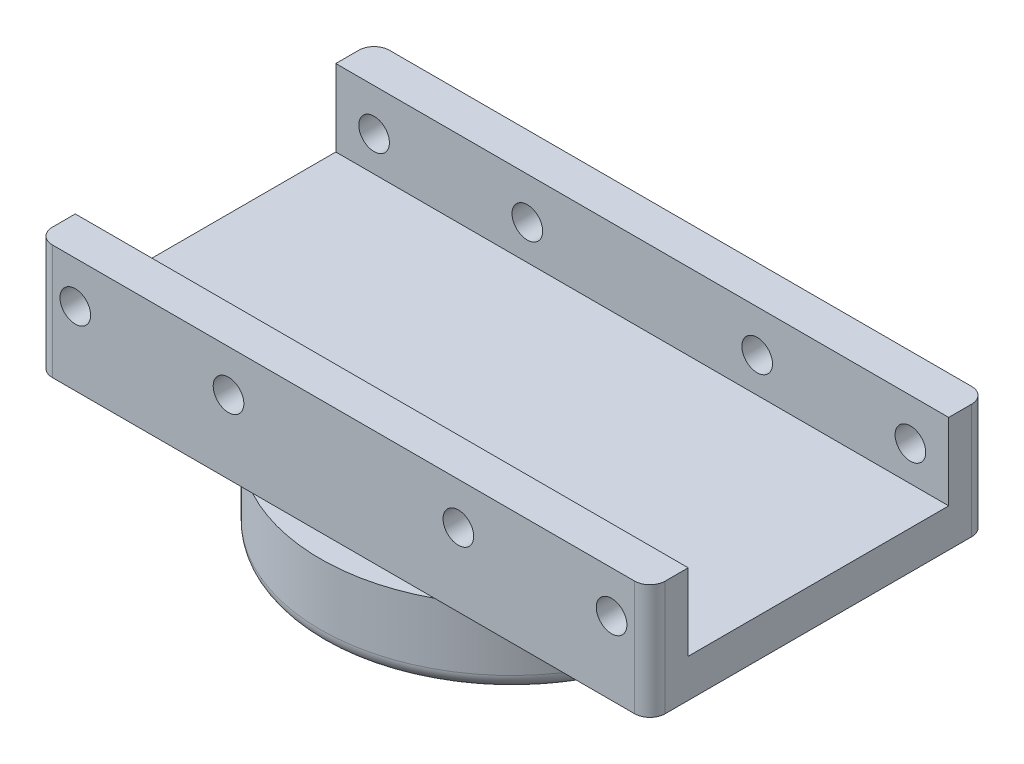
ISO-10303-21;
HEADER;
FILE_DESCRIPTION(('STEP AP214'),'2;1');
FILE_NAME('part.step','',(''),(''),'','','');
FILE_SCHEMA(('AUTOMOTIVE_DESIGN { 1 0 10303 214 1 1 1 1 }'));
ENDSEC;
DATA;
#1=APPLICATION_CONTEXT('core data for automotive mechanical design processes');
#2=APPLICATION_PROTOCOL_DEFINITION('international standard','automotive_design',2000,#1);
#3=PRODUCT_CONTEXT('',#1,'mechanical');
#4=PRODUCT('Part','Part','',(#3));
#5=PRODUCT_RELATED_PRODUCT_CATEGORY('part','',(#4));
#6=PRODUCT_DEFINITION_FORMATION('','',#4);
#7=PRODUCT_DEFINITION_CONTEXT('part definition',#1,'design');
#8=PRODUCT_DEFINITION('design','',#6,#7);
#9=PRODUCT_DEFINITION_SHAPE('','',#8);
#10=(LENGTH_UNIT() NAMED_UNIT(*) SI_UNIT(.MILLI.,.METRE.));
#11=(NAMED_UNIT(*) PLANE_ANGLE_UNIT() SI_UNIT($,.RADIAN.));
#12=(NAMED_UNIT(*) SI_UNIT($,.STERADIAN.) SOLID_ANGLE_UNIT());
#13=UNCERTAINTY_MEASURE_WITH_UNIT(LENGTH_MEASURE(1.E-05),#10,'distance_accuracy_value','');
#14=(GEOMETRIC_REPRESENTATION_CONTEXT(3) GLOBAL_UNCERTAINTY_ASSIGNED_CONTEXT((#13)) GLOBAL_UNIT_ASSIGNED_CONTEXT((#10,
#11,#12)) REPRESENTATION_CONTEXT('',''));
#15=CARTESIAN_POINT('',(0.,0.,0.));
#16=DIRECTION('',(0.,0.,1.));
#17=DIRECTION('',(1.,0.,0.));
#18=AXIS2_PLACEMENT_3D('',#15,#16,#17);
#19=CARTESIAN_POINT('',(0.,15.,0.));
#20=DIRECTION('',(0.,-1.,0.));
#21=DIRECTION('',(0.,0.,-1.));
#22=AXIS2_PLACEMENT_3D('',#19,#20,#21);
#23=PLANE('',#22);
#24=DIRECTION('',(-1.,0.,0.));
#25=VECTOR('',#24,1.);
#26=CARTESIAN_POINT('',(-40.,15.,17.));
#27=LINE('',#26,#25);
#28=CARTESIAN_POINT('',(40.,15.,17.));
#29=VERTEX_POINT('',#28);
#30=CARTESIAN_POINT('',(-40.,15.,17.));
#31=VERTEX_POINT('',#30);
#32=EDGE_CURVE('E165',#29,#31,#27,.T.);
#33=ORIENTED_EDGE('',*,*,#32,.F.);
#34=DIRECTION('',(0.,0.,-1.));
#35=VECTOR('',#34,1.);
#36=CARTESIAN_POINT('',(40.,15.,22.));
#37=LINE('',#36,#35);
#38=CARTESIAN_POINT('',(40.,15.,-17.));
#39=VERTEX_POINT('',#38);
#40=EDGE_CURVE('E152',#29,#39,#37,.T.);
#41=ORIENTED_EDGE('',*,*,#40,.T.);
#42=DIRECTION('',(1.,0.,0.));
#43=VECTOR('',#42,1.);
#44=CARTESIAN_POINT('',(-40.,15.,-17.));
#45=LINE('',#44,#43);
#46=CARTESIAN_POINT('',(-40.,15.,-17.));
#47=VERTEX_POINT('',#46);
#48=EDGE_CURVE('E155',#47,#39,#45,.T.);
#49=ORIENTED_EDGE('',*,*,#48,.F.);
#50=DIRECTION('',(0.,0.,1.));
#51=VECTOR('',#50,1.);
#52=CARTESIAN_POINT('',(-40.,15.,22.));
#53=LINE('',#52,#51);
#54=EDGE_CURVE('E188',#47,#31,#53,.T.);
#55=ORIENTED_EDGE('',*,*,#54,.T.);
#56=EDGE_LOOP('',(#33,#41,#49,#55));
#57=FACE_BOUND('',#56,.T.);
#58=ADVANCED_FACE('F33',(#57),#23,.F.);
#59=CARTESIAN_POINT('',(0.,10.,0.));
#60=DIRECTION('',(0.,1.,0.));
#61=DIRECTION('',(0.,0.,1.));
#62=AXIS2_PLACEMENT_3D('',#59,#60,#61);
#63=PLANE('',#62);
#64=DIRECTION('',(1.,0.,0.));
#65=VECTOR('',#64,1.);
#66=CARTESIAN_POINT('',(-40.,10.,22.));
#67=LINE('',#66,#65);
#68=CARTESIAN_POINT('',(-11.8743420870379,10.,22.));
#69=VERTEX_POINT('',#68);
#70=CARTESIAN_POINT('',(11.8743420870379,10.,22.));
#71=VERTEX_POINT('',#70);
#72=EDGE_CURVE('E202',#69,#71,#67,.T.);
#73=ORIENTED_EDGE('',*,*,#72,.F.);
#74=CARTESIAN_POINT('',(0.,10.,0.));
#75=DIRECTION('',(0.,1.,0.));
#76=DIRECTION('',(0.,0.,1.));
#77=AXIS2_PLACEMENT_3D('',#74,#75,#76);
#78=CIRCLE('',#77,25.);
#79=EDGE_CURVE('E191',#69,#71,#78,.T.);
#80=ORIENTED_EDGE('',*,*,#79,.T.);
#81=EDGE_LOOP('',(#73,#80));
#82=FACE_BOUND('',#81,.T.);
#83=ADVANCED_FACE('F286',(#82),#63,.T.);
#84=CARTESIAN_POINT('',(0.,10.,0.));
#85=DIRECTION('',(0.,-1.,0.));
#86=DIRECTION('',(0.,0.,-1.));
#87=AXIS2_PLACEMENT_3D('',#84,#85,#86);
#88=CYLINDRICAL_SURFACE('',#87,25.);
#89=CARTESIAN_POINT('',(0.,2.,0.));
#90=DIRECTION('',(0.,1.,0.));
#91=DIRECTION('',(0.,0.,1.));
#92=AXIS2_PLACEMENT_3D('',#89,#90,#91);
#93=CIRCLE('',#92,25.);
#94=CARTESIAN_POINT('',(0.,2.,25.));
#95=VERTEX_POINT('',#94);
#96=EDGE_CURVE('E216',#95,#95,#93,.T.);
#97=ORIENTED_EDGE('',*,*,#96,.T.);
#98=EDGE_LOOP('',(#97));
#99=FACE_BOUND('',#98,.T.);
#100=CARTESIAN_POINT('',(11.8743420870379,10.,-22.));
#101=VERTEX_POINT('',#100);
#102=EDGE_CURVE('E203',#71,#101,#78,.T.);
#103=ORIENTED_EDGE('',*,*,#102,.F.);
#104=ORIENTED_EDGE('',*,*,#79,.F.);
#105=CARTESIAN_POINT('',(-11.8743420870379,10.,-22.));
#106=VERTEX_POINT('',#105);
#107=EDGE_CURVE('E420',#106,#69,#78,.T.);
#108=ORIENTED_EDGE('',*,*,#107,.F.);
#109=EDGE_CURVE('E207',#101,#106,#78,.T.);
#110=ORIENTED_EDGE('',*,*,#109,.F.);
#111=EDGE_LOOP('',(#103,#104,#108,#110));
#112=FACE_BOUND('',#111,.T.);
#113=ADVANCED_FACE('F294',(#99,#112),#88,.T.);
#114=DIRECTION('',(-1.,0.,0.));
#115=VECTOR('',#114,1.);
#116=CARTESIAN_POINT('',(-40.,10.,-22.));
#117=LINE('',#116,#115);
#118=EDGE_CURVE('E197',#101,#106,#117,.T.);
#119=ORIENTED_EDGE('',*,*,#118,.F.);
#120=ORIENTED_EDGE('',*,*,#109,.T.);
#121=EDGE_LOOP('',(#119,#120));
#122=FACE_BOUND('',#121,.T.);
#123=ADVANCED_FACE('F297',(#122),#63,.T.);
#124=CARTESIAN_POINT('',(0.,0.,0.));
#125=DIRECTION('',(0.,1.,0.));
#126=DIRECTION('',(0.,0.,1.));
#127=AXIS2_PLACEMENT_3D('',#124,#125,#126);
#128=PLANE('',#127);
#129=CARTESIAN_POINT('',(0.,0.,0.));
#130=DIRECTION('',(0.,1.,0.));
#131=DIRECTION('',(0.,0.,1.));
#132=AXIS2_PLACEMENT_3D('',#129,#130,#131);
#133=CIRCLE('',#132,23.);
#134=CARTESIAN_POINT('',(0.,0.,23.));
#135=VERTEX_POINT('',#134);
#136=EDGE_CURVE('E219',#135,#135,#133,.F.);
#137=ORIENTED_EDGE('',*,*,#136,.T.);
#138=EDGE_LOOP('',(#137));
#139=FACE_BOUND('',#138,.T.);
#140=CARTESIAN_POINT('',(0.,0.,0.));
#141=DIRECTION('',(0.,1.,0.));
#142=DIRECTION('',(0.,0.,1.));
#143=AXIS2_PLACEMENT_3D('',#140,#141,#142);
#144=CIRCLE('',#143,10.);
#145=CARTESIAN_POINT('',(0.,0.,10.));
#146=VERTEX_POINT('',#145);
#147=EDGE_CURVE('E206',#146,#146,#144,.F.);
#148=ORIENTED_EDGE('',*,*,#147,.F.);
#149=EDGE_LOOP('',(#148));
#150=FACE_BOUND('',#149,.T.);
#151=ADVANCED_FACE('F326',(#139,#150),#128,.F.);
#152=CARTESIAN_POINT('',(0.,-10.,0.));
#153=DIRECTION('',(0.,1.,0.));
#154=DIRECTION('',(0.,0.,1.));
#155=AXIS2_PLACEMENT_3D('',#152,#153,#154);
#156=CYLINDRICAL_SURFACE('',#155,10.);
#157=CARTESIAN_POINT('',(0.,-8.,0.));
#158=DIRECTION('',(0.,-1.,0.));
#159=DIRECTION('',(0.,0.,-1.));
#160=AXIS2_PLACEMENT_3D('',#157,#158,#159);
#161=CIRCLE('',#160,10.);
#162=CARTESIAN_POINT('',(0.,-8.,-10.));
#163=VERTEX_POINT('',#162);
#164=EDGE_CURVE('E213',#163,#163,#161,.F.);
#165=ORIENTED_EDGE('',*,*,#164,.T.);
#166=EDGE_LOOP('',(#165));
#167=FACE_BOUND('',#166,.T.);
#168=ORIENTED_EDGE('',*,*,#147,.T.);
#169=EDGE_LOOP('',(#168));
#170=FACE_BOUND('',#169,.T.);
#171=ADVANCED_FACE('F323',(#167,#170),#156,.T.);
#172=CARTESIAN_POINT('',(0.,-10.,0.));
#173=DIRECTION('',(0.,-1.,0.));
#174=DIRECTION('',(0.,0.,-1.));
#175=AXIS2_PLACEMENT_3D('',#172,#173,#174);
#176=PLANE('',#175);
#177=CARTESIAN_POINT('',(0.,-10.,0.));
#178=DIRECTION('',(0.,-1.,0.));
#179=DIRECTION('',(0.,0.,-1.));
#180=AXIS2_PLACEMENT_3D('',#177,#178,#179);
#181=CIRCLE('',#180,8.);
#182=CARTESIAN_POINT('',(0.,-10.,-8.));
#183=VERTEX_POINT('',#182);
#184=EDGE_CURVE('E210',#183,#183,#181,.T.);
#185=ORIENTED_EDGE('',*,*,#184,.T.);
#186=EDGE_LOOP('',(#185));
#187=FACE_BOUND('',#186,.T.);
#188=ADVANCED_FACE('F319',(#187),#176,.T.);
#189=CARTESIAN_POINT('',(0.,-8.,0.));
#190=DIRECTION('',(0.,-1.,0.));
#191=DIRECTION('',(0.,0.,-1.));
#192=AXIS2_PLACEMENT_3D('',#189,#190,#191);
#193=TOROIDAL_SURFACE('',#192,8.,2.);
#194=ORIENTED_EDGE('',*,*,#164,.F.);
#195=EDGE_LOOP('',(#194));
#196=FACE_BOUND('',#195,.T.);
#197=ORIENTED_EDGE('',*,*,#184,.F.);
#198=EDGE_LOOP('',(#197));
#199=FACE_BOUND('',#198,.T.);
#200=ADVANCED_FACE('F322',(#196,#199),#193,.T.);
#201=CARTESIAN_POINT('',(0.,2.,0.));
#202=DIRECTION('',(0.,1.,0.));
#203=DIRECTION('',(0.,0.,1.));
#204=AXIS2_PLACEMENT_3D('',#201,#202,#203);
#205=TOROIDAL_SURFACE('',#204,23.,2.);
#206=ORIENTED_EDGE('',*,*,#136,.F.);
#207=EDGE_LOOP('',(#206));
#208=FACE_BOUND('',#207,.T.);
#209=ORIENTED_EDGE('',*,*,#96,.F.);
#210=EDGE_LOOP('',(#209));
#211=FACE_BOUND('',#210,.T.);
#212=ADVANCED_FACE('F338',(#208,#211),#205,.T.);
#213=CARTESIAN_POINT('',(0.,10.,0.));
#214=DIRECTION('',(0.,-1.,0.));
#215=DIRECTION('',(0.,0.,-1.));
#216=AXIS2_PLACEMENT_3D('',#213,#214,#215);
#217=PLANE('',#216);
#218=CARTESIAN_POINT('',(38.,10.,-22.));
#219=VERTEX_POINT('',#218);
#220=EDGE_CURVE('E194',#219,#101,#117,.T.);
#221=ORIENTED_EDGE('',*,*,#220,.F.);
#222=CARTESIAN_POINT('',(38.,10.,-20.));
#223=DIRECTION('',(0.,-1.,0.));
#224=DIRECTION('',(0.,0.,-1.));
#225=AXIS2_PLACEMENT_3D('',#222,#223,#224);
#226=CIRCLE('',#225,2.);
#227=CARTESIAN_POINT('',(40.,10.,-20.));
#228=VERTEX_POINT('',#227);
#229=EDGE_CURVE('E48',#219,#228,#226,.T.);
#230=ORIENTED_EDGE('',*,*,#229,.T.);
#231=DIRECTION('',(0.,0.,-1.));
#232=VECTOR('',#231,1.);
#233=CARTESIAN_POINT('',(40.,10.,22.));
#234=LINE('',#233,#232);
#235=CARTESIAN_POINT('',(40.,10.,20.));
#236=VERTEX_POINT('',#235);
#237=EDGE_CURVE('E186',#236,#228,#234,.T.);
#238=ORIENTED_EDGE('',*,*,#237,.F.);
#239=CARTESIAN_POINT('',(38.,10.,20.));
#240=DIRECTION('',(0.,-1.,0.));
#241=DIRECTION('',(0.,0.,-1.));
#242=AXIS2_PLACEMENT_3D('',#239,#240,#241);
#243=CIRCLE('',#242,2.);
#244=CARTESIAN_POINT('',(38.,10.,22.));
#245=VERTEX_POINT('',#244);
#246=EDGE_CURVE('E56',#236,#245,#243,.T.);
#247=ORIENTED_EDGE('',*,*,#246,.T.);
#248=EDGE_CURVE('E200',#71,#245,#67,.T.);
#249=ORIENTED_EDGE('',*,*,#248,.F.);
#250=ORIENTED_EDGE('',*,*,#102,.T.);
#251=EDGE_LOOP('',(#221,#230,#238,#247,#249,#250));
#252=FACE_BOUND('',#251,.T.);
#253=ADVANCED_FACE('F270',(#252),#217,.T.);
#254=CARTESIAN_POINT('',(40.,15.,22.));
#255=DIRECTION('',(-1.,0.,0.));
#256=DIRECTION('',(0.,0.,1.));
#257=AXIS2_PLACEMENT_3D('',#254,#255,#256);
#258=PLANE('',#257);
#259=ORIENTED_EDGE('',*,*,#237,.T.);
#260=DIRECTION('',(0.,-1.,0.));
#261=VECTOR('',#260,1.);
#262=CARTESIAN_POINT('',(40.,15.,-20.));
#263=LINE('',#262,#261);
#264=CARTESIAN_POINT('',(40.,25.,-20.));
#265=VERTEX_POINT('',#264);
#266=EDGE_CURVE('E11',#228,#265,#263,.F.);
#267=ORIENTED_EDGE('',*,*,#266,.T.);
#268=DIRECTION('',(0.,0.,-1.));
#269=VECTOR('',#268,1.);
#270=CARTESIAN_POINT('',(40.,25.,-22.));
#271=LINE('',#270,#269);
#272=CARTESIAN_POINT('',(40.,25.,-17.));
#273=VERTEX_POINT('',#272);
#274=EDGE_CURVE('E173',#273,#265,#271,.T.);
#275=ORIENTED_EDGE('',*,*,#274,.F.);
#276=DIRECTION('',(0.,-1.,0.));
#277=VECTOR('',#276,1.);
#278=CARTESIAN_POINT('',(40.,25.,-17.));
#279=LINE('',#278,#277);
#280=EDGE_CURVE('E179',#273,#39,#279,.T.);
#281=ORIENTED_EDGE('',*,*,#280,.T.);
#282=ORIENTED_EDGE('',*,*,#40,.F.);
#283=DIRECTION('',(0.,-1.,0.));
#284=VECTOR('',#283,1.);
#285=CARTESIAN_POINT('',(40.,25.,17.));
#286=LINE('',#285,#284);
#287=CARTESIAN_POINT('',(40.,25.,17.));
#288=VERTEX_POINT('',#287);
#289=EDGE_CURVE('E149',#288,#29,#286,.T.);
#290=ORIENTED_EDGE('',*,*,#289,.F.);
#291=DIRECTION('',(0.,0.,-1.));
#292=VECTOR('',#291,1.);
#293=CARTESIAN_POINT('',(40.,25.,22.));
#294=LINE('',#293,#292);
#295=CARTESIAN_POINT('',(40.,25.,20.));
#296=VERTEX_POINT('',#295);
#297=EDGE_CURVE('E134',#296,#288,#294,.T.);
#298=ORIENTED_EDGE('',*,*,#297,.F.);
#299=DIRECTION('',(0.,-1.,0.));
#300=VECTOR('',#299,1.);
#301=CARTESIAN_POINT('',(40.,15.,20.));
#302=LINE('',#301,#300);
#303=EDGE_CURVE('E41',#296,#236,#302,.T.);
#304=ORIENTED_EDGE('',*,*,#303,.T.);
#305=EDGE_LOOP('',(#259,#267,#275,#281,#282,#290,#298,#304));
#306=FACE_BOUND('',#305,.T.);
#307=ADVANCED_FACE('F150',(#306),#258,.F.);
#308=CARTESIAN_POINT('',(-40.,15.,-22.));
#309=DIRECTION('',(0.,0.,1.));
#310=DIRECTION('',(1.,0.,0.));
#311=AXIS2_PLACEMENT_3D('',#308,#309,#310);
#312=PLANE('',#311);
#313=CARTESIAN_POINT('',(35.,19.5450820887655,-22.));
#314=DIRECTION('',(0.,0.,-1.));
#315=DIRECTION('',(-1.,0.,0.));
#316=AXIS2_PLACEMENT_3D('',#313,#314,#315);
#317=CIRCLE('',#316,2.);
#318=CARTESIAN_POINT('',(33.,19.5450820887655,-22.));
#319=VERTEX_POINT('',#318);
#320=EDGE_CURVE('E231',#319,#319,#317,.T.);
#321=ORIENTED_EDGE('',*,*,#320,.F.);
#322=EDGE_LOOP('',(#321));
#323=FACE_BOUND('',#322,.T.);
#324=CARTESIAN_POINT('',(-15.,19.5450820887655,-22.));
#325=DIRECTION('',(0.,0.,-1.));
#326=DIRECTION('',(1.,0.,0.));
#327=AXIS2_PLACEMENT_3D('',#324,#325,#326);
#328=CIRCLE('',#327,2.);
#329=CARTESIAN_POINT('',(-13.,19.5450820887655,-22.));
#330=VERTEX_POINT('',#329);
#331=EDGE_CURVE('E380',#330,#330,#328,.T.);
#332=ORIENTED_EDGE('',*,*,#331,.F.);
#333=EDGE_LOOP('',(#332));
#334=FACE_BOUND('',#333,.T.);
#335=CARTESIAN_POINT('',(-35.,19.5450820887655,-22.));
#336=DIRECTION('',(0.,0.,-1.));
#337=DIRECTION('',(1.,0.,0.));
#338=AXIS2_PLACEMENT_3D('',#335,#336,#337);
#339=CIRCLE('',#338,2.);
#340=CARTESIAN_POINT('',(-33.,19.5450820887655,-22.));
#341=VERTEX_POINT('',#340);
#342=EDGE_CURVE('E377',#341,#341,#339,.T.);
#343=ORIENTED_EDGE('',*,*,#342,.F.);
#344=EDGE_LOOP('',(#343));
#345=FACE_BOUND('',#344,.T.);
#346=CARTESIAN_POINT('',(15.,19.5450820887655,-22.));
#347=DIRECTION('',(0.,0.,-1.));
#348=DIRECTION('',(-1.,0.,0.));
#349=AXIS2_PLACEMENT_3D('',#346,#347,#348);
#350=CIRCLE('',#349,2.);
#351=CARTESIAN_POINT('',(13.,19.5450820887655,-22.));
#352=VERTEX_POINT('',#351);
#353=EDGE_CURVE('E226',#352,#352,#350,.T.);
#354=ORIENTED_EDGE('',*,*,#353,.F.);
#355=EDGE_LOOP('',(#354));
#356=FACE_BOUND('',#355,.T.);
#357=CARTESIAN_POINT('',(-38.,10.,-22.));
#358=VERTEX_POINT('',#357);
#359=EDGE_CURVE('E193',#106,#358,#117,.T.);
#360=ORIENTED_EDGE('',*,*,#359,.T.);
#361=DIRECTION('',(0.,-1.,0.));
#362=VECTOR('',#361,1.);
#363=CARTESIAN_POINT('',(-38.,15.,-22.));
#364=LINE('',#363,#362);
#365=CARTESIAN_POINT('',(-38.,25.,-22.));
#366=VERTEX_POINT('',#365);
#367=EDGE_CURVE('E254',#358,#366,#364,.F.);
#368=ORIENTED_EDGE('',*,*,#367,.T.);
#369=DIRECTION('',(-1.,0.,0.));
#370=VECTOR('',#369,1.);
#371=CARTESIAN_POINT('',(-40.,25.,-22.));
#372=LINE('',#371,#370);
#373=CARTESIAN_POINT('',(38.,25.,-22.));
#374=VERTEX_POINT('',#373);
#375=EDGE_CURVE('E176',#374,#366,#372,.T.);
#376=ORIENTED_EDGE('',*,*,#375,.F.);
#377=DIRECTION('',(0.,-1.,0.));
#378=VECTOR('',#377,1.);
#379=CARTESIAN_POINT('',(38.,15.,-22.));
#380=LINE('',#379,#378);
#381=EDGE_CURVE('E251',#374,#219,#380,.T.);
#382=ORIENTED_EDGE('',*,*,#381,.T.);
#383=ORIENTED_EDGE('',*,*,#220,.T.);
#384=ORIENTED_EDGE('',*,*,#118,.T.);
#385=EDGE_LOOP('',(#360,#368,#376,#382,#383,#384));
#386=FACE_BOUND('',#385,.T.);
#387=ADVANCED_FACE('F312',(#323,#334,#345,#356,#386),#312,.F.);
#388=CARTESIAN_POINT('',(-40.,15.,22.));
#389=DIRECTION('',(1.,0.,0.));
#390=DIRECTION('',(0.,0.,-1.));
#391=AXIS2_PLACEMENT_3D('',#388,#389,#390);
#392=PLANE('',#391);
#393=DIRECTION('',(0.,0.,1.));
#394=VECTOR('',#393,1.);
#395=CARTESIAN_POINT('',(-40.,25.,-22.));
#396=LINE('',#395,#394);
#397=CARTESIAN_POINT('',(-40.,25.,-20.));
#398=VERTEX_POINT('',#397);
#399=CARTESIAN_POINT('',(-40.,25.,-17.));
#400=VERTEX_POINT('',#399);
#401=EDGE_CURVE('E169',#398,#400,#396,.T.);
#402=ORIENTED_EDGE('',*,*,#401,.F.);
#403=DIRECTION('',(0.,-1.,0.));
#404=VECTOR('',#403,1.);
#405=CARTESIAN_POINT('',(-40.,15.,-20.));
#406=LINE('',#405,#404);
#407=CARTESIAN_POINT('',(-40.,10.,-20.));
#408=VERTEX_POINT('',#407);
#409=EDGE_CURVE('E244',#398,#408,#406,.T.);
#410=ORIENTED_EDGE('',*,*,#409,.T.);
#411=DIRECTION('',(0.,0.,1.));
#412=VECTOR('',#411,1.);
#413=CARTESIAN_POINT('',(-40.,10.,22.));
#414=LINE('',#413,#412);
#415=CARTESIAN_POINT('',(-40.,10.,20.));
#416=VERTEX_POINT('',#415);
#417=EDGE_CURVE('E196',#408,#416,#414,.T.);
#418=ORIENTED_EDGE('',*,*,#417,.T.);
#419=DIRECTION('',(0.,-1.,0.));
#420=VECTOR('',#419,1.);
#421=CARTESIAN_POINT('',(-40.,15.,20.));
#422=LINE('',#421,#420);
#423=CARTESIAN_POINT('',(-40.,25.,20.));
#424=VERTEX_POINT('',#423);
#425=EDGE_CURVE('E242',#416,#424,#422,.F.);
#426=ORIENTED_EDGE('',*,*,#425,.T.);
#427=DIRECTION('',(0.,0.,1.));
#428=VECTOR('',#427,1.);
#429=CARTESIAN_POINT('',(-40.,25.,22.));
#430=LINE('',#429,#428);
#431=CARTESIAN_POINT('',(-40.,25.,17.));
#432=VERTEX_POINT('',#431);
#433=EDGE_CURVE('E166',#432,#424,#430,.T.);
#434=ORIENTED_EDGE('',*,*,#433,.F.);
#435=DIRECTION('',(0.,-1.,0.));
#436=VECTOR('',#435,1.);
#437=CARTESIAN_POINT('',(-40.,25.,17.));
#438=LINE('',#437,#436);
#439=EDGE_CURVE('E156',#432,#31,#438,.T.);
#440=ORIENTED_EDGE('',*,*,#439,.T.);
#441=ORIENTED_EDGE('',*,*,#54,.F.);
#442=DIRECTION('',(0.,-1.,0.));
#443=VECTOR('',#442,1.);
#444=CARTESIAN_POINT('',(-40.,25.,-17.));
#445=LINE('',#444,#443);
#446=EDGE_CURVE('E183',#400,#47,#445,.T.);
#447=ORIENTED_EDGE('',*,*,#446,.F.);
#448=EDGE_LOOP('',(#402,#410,#418,#426,#434,#440,#441,#447));
#449=FACE_BOUND('',#448,.T.);
#450=ADVANCED_FACE('F308',(#449),#392,.F.);
#451=CARTESIAN_POINT('',(-40.,15.,22.));
#452=DIRECTION('',(0.,0.,-1.));
#453=DIRECTION('',(-1.,0.,0.));
#454=AXIS2_PLACEMENT_3D('',#451,#452,#453);
#455=PLANE('',#454);
#456=CARTESIAN_POINT('',(35.,19.5450820887655,22.));
#457=DIRECTION('',(0.,0.,-1.));
#458=DIRECTION('',(-1.,0.,0.));
#459=AXIS2_PLACEMENT_3D('',#456,#457,#458);
#460=CIRCLE('',#459,2.);
#461=CARTESIAN_POINT('',(33.,19.5450820887655,22.));
#462=VERTEX_POINT('',#461);
#463=EDGE_CURVE('E364',#462,#462,#460,.T.);
#464=ORIENTED_EDGE('',*,*,#463,.T.);
#465=EDGE_LOOP('',(#464));
#466=FACE_BOUND('',#465,.T.);
#467=CARTESIAN_POINT('',(-15.,19.5450820887655,22.));
#468=DIRECTION('',(0.,0.,-1.));
#469=DIRECTION('',(-1.,0.,0.));
#470=AXIS2_PLACEMENT_3D('',#467,#468,#469);
#471=CIRCLE('',#470,2.);
#472=CARTESIAN_POINT('',(-17.,19.5450820887655,22.));
#473=VERTEX_POINT('',#472);
#474=EDGE_CURVE('E241',#473,#473,#471,.T.);
#475=ORIENTED_EDGE('',*,*,#474,.T.);
#476=EDGE_LOOP('',(#475));
#477=FACE_BOUND('',#476,.T.);
#478=CARTESIAN_POINT('',(-35.,19.5450820887655,22.));
#479=DIRECTION('',(0.,0.,-1.));
#480=DIRECTION('',(-1.,0.,0.));
#481=AXIS2_PLACEMENT_3D('',#478,#479,#480);
#482=CIRCLE('',#481,2.);
#483=CARTESIAN_POINT('',(-37.,19.5450820887655,22.));
#484=VERTEX_POINT('',#483);
#485=EDGE_CURVE('E236',#484,#484,#482,.T.);
#486=ORIENTED_EDGE('',*,*,#485,.T.);
#487=EDGE_LOOP('',(#486));
#488=FACE_BOUND('',#487,.T.);
#489=CARTESIAN_POINT('',(15.,19.5450820887655,22.));
#490=DIRECTION('',(0.,0.,-1.));
#491=DIRECTION('',(-1.,0.,0.));
#492=AXIS2_PLACEMENT_3D('',#489,#490,#491);
#493=CIRCLE('',#492,2.);
#494=CARTESIAN_POINT('',(13.,19.5450820887655,22.));
#495=VERTEX_POINT('',#494);
#496=EDGE_CURVE('E167',#495,#495,#493,.T.);
#497=ORIENTED_EDGE('',*,*,#496,.T.);
#498=EDGE_LOOP('',(#497));
#499=FACE_BOUND('',#498,.T.);
#500=DIRECTION('',(1.,0.,0.));
#501=VECTOR('',#500,1.);
#502=CARTESIAN_POINT('',(-40.,25.,22.));
#503=LINE('',#502,#501);
#504=CARTESIAN_POINT('',(-38.,25.,22.));
#505=VERTEX_POINT('',#504);
#506=CARTESIAN_POINT('',(38.,25.,22.));
#507=VERTEX_POINT('',#506);
#508=EDGE_CURVE('E145',#505,#507,#503,.T.);
#509=ORIENTED_EDGE('',*,*,#508,.F.);
#510=DIRECTION('',(0.,-1.,0.));
#511=VECTOR('',#510,1.);
#512=CARTESIAN_POINT('',(-38.,15.,22.));
#513=LINE('',#512,#511);
#514=CARTESIAN_POINT('',(-38.,10.,22.));
#515=VERTEX_POINT('',#514);
#516=EDGE_CURVE('E262',#505,#515,#513,.T.);
#517=ORIENTED_EDGE('',*,*,#516,.T.);
#518=EDGE_CURVE('E189',#515,#69,#67,.T.);
#519=ORIENTED_EDGE('',*,*,#518,.T.);
#520=ORIENTED_EDGE('',*,*,#72,.T.);
#521=ORIENTED_EDGE('',*,*,#248,.T.);
#522=DIRECTION('',(0.,-1.,0.));
#523=VECTOR('',#522,1.);
#524=CARTESIAN_POINT('',(38.,15.,22.));
#525=LINE('',#524,#523);
#526=EDGE_CURVE('E260',#245,#507,#525,.F.);
#527=ORIENTED_EDGE('',*,*,#526,.T.);
#528=EDGE_LOOP('',(#509,#517,#519,#520,#521,#527));
#529=FACE_BOUND('',#528,.T.);
#530=ADVANCED_FACE('F276',(#466,#477,#488,#499,#529),#455,.F.);
#531=ORIENTED_EDGE('',*,*,#417,.F.);
#532=CARTESIAN_POINT('',(-38.,10.,-20.));
#533=DIRECTION('',(0.,-1.,0.));
#534=DIRECTION('',(0.,0.,-1.));
#535=AXIS2_PLACEMENT_3D('',#532,#533,#534);
#536=CIRCLE('',#535,2.);
#537=EDGE_CURVE('E249',#408,#358,#536,.T.);
#538=ORIENTED_EDGE('',*,*,#537,.T.);
#539=ORIENTED_EDGE('',*,*,#359,.F.);
#540=ORIENTED_EDGE('',*,*,#107,.T.);
#541=ORIENTED_EDGE('',*,*,#518,.F.);
#542=CARTESIAN_POINT('',(-38.,10.,20.));
#543=DIRECTION('',(0.,-1.,0.));
#544=DIRECTION('',(0.,0.,-1.));
#545=AXIS2_PLACEMENT_3D('',#542,#543,#544);
#546=CIRCLE('',#545,2.);
#547=EDGE_CURVE('E247',#515,#416,#546,.T.);
#548=ORIENTED_EDGE('',*,*,#547,.T.);
#549=EDGE_LOOP('',(#531,#538,#539,#540,#541,#548));
#550=FACE_BOUND('',#549,.T.);
#551=ADVANCED_FACE('F302',(#550),#217,.T.);
#552=CARTESIAN_POINT('',(-40.,25.,-17.));
#553=DIRECTION('',(0.,0.,-1.));
#554=DIRECTION('',(-1.,0.,0.));
#555=AXIS2_PLACEMENT_3D('',#552,#553,#554);
#556=PLANE('',#555);
#557=CARTESIAN_POINT('',(35.,19.5450820887655,-17.));
#558=DIRECTION('',(0.,0.,-1.));
#559=DIRECTION('',(-1.,0.,0.));
#560=AXIS2_PLACEMENT_3D('',#557,#558,#559);
#561=CIRCLE('',#560,2.);
#562=CARTESIAN_POINT('',(33.,19.5450820887655,-17.));
#563=VERTEX_POINT('',#562);
#564=EDGE_CURVE('E240',#563,#563,#561,.T.);
#565=ORIENTED_EDGE('',*,*,#564,.T.);
#566=EDGE_LOOP('',(#565));
#567=FACE_BOUND('',#566,.T.);
#568=CARTESIAN_POINT('',(-15.,19.5450820887655,-17.));
#569=DIRECTION('',(0.,0.,-1.));
#570=DIRECTION('',(-1.,0.,0.));
#571=AXIS2_PLACEMENT_3D('',#568,#569,#570);
#572=CIRCLE('',#571,2.);
#573=CARTESIAN_POINT('',(-17.,19.5450820887655,-17.));
#574=VERTEX_POINT('',#573);
#575=EDGE_CURVE('E235',#574,#574,#572,.T.);
#576=ORIENTED_EDGE('',*,*,#575,.T.);
#577=EDGE_LOOP('',(#576));
#578=FACE_BOUND('',#577,.T.);
#579=CARTESIAN_POINT('',(-35.,19.5450820887655,-17.));
#580=DIRECTION('',(0.,0.,-1.));
#581=DIRECTION('',(-1.,0.,0.));
#582=AXIS2_PLACEMENT_3D('',#579,#580,#581);
#583=CIRCLE('',#582,2.);
#584=CARTESIAN_POINT('',(-37.,19.5450820887655,-17.));
#585=VERTEX_POINT('',#584);
#586=EDGE_CURVE('E230',#585,#585,#583,.T.);
#587=ORIENTED_EDGE('',*,*,#586,.T.);
#588=EDGE_LOOP('',(#587));
#589=FACE_BOUND('',#588,.T.);
#590=CARTESIAN_POINT('',(15.,19.5450820887655,-17.));
#591=DIRECTION('',(0.,0.,-1.));
#592=DIRECTION('',(-1.,0.,0.));
#593=AXIS2_PLACEMENT_3D('',#590,#591,#592);
#594=CIRCLE('',#593,2.);
#595=CARTESIAN_POINT('',(13.,19.5450820887655,-17.));
#596=VERTEX_POINT('',#595);
#597=EDGE_CURVE('E225',#596,#596,#594,.T.);
#598=ORIENTED_EDGE('',*,*,#597,.T.);
#599=EDGE_LOOP('',(#598));
#600=FACE_BOUND('',#599,.T.);
#601=ORIENTED_EDGE('',*,*,#48,.T.);
#602=ORIENTED_EDGE('',*,*,#280,.F.);
#603=DIRECTION('',(1.,0.,0.));
#604=VECTOR('',#603,1.);
#605=CARTESIAN_POINT('',(-40.,25.,-17.));
#606=LINE('',#605,#604);
#607=EDGE_CURVE('E171',#400,#273,#606,.T.);
#608=ORIENTED_EDGE('',*,*,#607,.F.);
#609=ORIENTED_EDGE('',*,*,#446,.T.);
#610=EDGE_LOOP('',(#601,#602,#608,#609));
#611=FACE_BOUND('',#610,.T.);
#612=ADVANCED_FACE('F300',(#567,#578,#589,#600,#611),#556,.F.);
#613=CARTESIAN_POINT('',(0.,25.,0.));
#614=DIRECTION('',(0.,1.,0.));
#615=DIRECTION('',(0.,0.,1.));
#616=AXIS2_PLACEMENT_3D('',#613,#614,#615);
#617=PLANE('',#616);
#618=ORIENTED_EDGE('',*,*,#375,.T.);
#619=CARTESIAN_POINT('',(-38.,25.,-20.));
#620=DIRECTION('',(0.,1.,0.));
#621=DIRECTION('',(0.,0.,1.));
#622=AXIS2_PLACEMENT_3D('',#619,#620,#621);
#623=CIRCLE('',#622,2.);
#624=EDGE_CURVE('E258',#366,#398,#623,.T.);
#625=ORIENTED_EDGE('',*,*,#624,.T.);
#626=ORIENTED_EDGE('',*,*,#401,.T.);
#627=ORIENTED_EDGE('',*,*,#607,.T.);
#628=ORIENTED_EDGE('',*,*,#274,.T.);
#629=CARTESIAN_POINT('',(38.,25.,-20.));
#630=DIRECTION('',(0.,1.,0.));
#631=DIRECTION('',(0.,0.,1.));
#632=AXIS2_PLACEMENT_3D('',#629,#630,#631);
#633=CIRCLE('',#632,2.);
#634=EDGE_CURVE('E256',#265,#374,#633,.T.);
#635=ORIENTED_EDGE('',*,*,#634,.T.);
#636=EDGE_LOOP('',(#618,#625,#626,#627,#628,#635));
#637=FACE_BOUND('',#636,.T.);
#638=ADVANCED_FACE('F405',(#637),#617,.T.);
#639=CARTESIAN_POINT('',(-40.,25.,17.));
#640=DIRECTION('',(0.,0.,1.));
#641=DIRECTION('',(1.,0.,0.));
#642=AXIS2_PLACEMENT_3D('',#639,#640,#641);
#643=PLANE('',#642);
#644=CARTESIAN_POINT('',(35.,19.5450820887655,17.));
#645=DIRECTION('',(0.,0.,1.));
#646=DIRECTION('',(1.,0.,0.));
#647=AXIS2_PLACEMENT_3D('',#644,#645,#646);
#648=CIRCLE('',#647,2.);
#649=CARTESIAN_POINT('',(37.,19.5450820887655,17.));
#650=VERTEX_POINT('',#649);
#651=EDGE_CURVE('E237',#650,#650,#648,.T.);
#652=ORIENTED_EDGE('',*,*,#651,.T.);
#653=EDGE_LOOP('',(#652));
#654=FACE_BOUND('',#653,.T.);
#655=CARTESIAN_POINT('',(-15.,19.5450820887655,17.));
#656=DIRECTION('',(0.,0.,1.));
#657=DIRECTION('',(1.,0.,0.));
#658=AXIS2_PLACEMENT_3D('',#655,#656,#657);
#659=CIRCLE('',#658,2.);
#660=CARTESIAN_POINT('',(-13.,19.5450820887655,17.));
#661=VERTEX_POINT('',#660);
#662=EDGE_CURVE('E232',#661,#661,#659,.T.);
#663=ORIENTED_EDGE('',*,*,#662,.T.);
#664=EDGE_LOOP('',(#663));
#665=FACE_BOUND('',#664,.T.);
#666=CARTESIAN_POINT('',(-35.,19.5450820887655,17.));
#667=DIRECTION('',(0.,0.,1.));
#668=DIRECTION('',(1.,0.,0.));
#669=AXIS2_PLACEMENT_3D('',#666,#667,#668);
#670=CIRCLE('',#669,2.);
#671=CARTESIAN_POINT('',(-33.,19.5450820887655,17.));
#672=VERTEX_POINT('',#671);
#673=EDGE_CURVE('E227',#672,#672,#670,.T.);
#674=ORIENTED_EDGE('',*,*,#673,.T.);
#675=EDGE_LOOP('',(#674));
#676=FACE_BOUND('',#675,.T.);
#677=CARTESIAN_POINT('',(15.,19.5450820887655,17.));
#678=DIRECTION('',(0.,0.,1.));
#679=DIRECTION('',(1.,0.,0.));
#680=AXIS2_PLACEMENT_3D('',#677,#678,#679);
#681=CIRCLE('',#680,2.);
#682=CARTESIAN_POINT('',(17.,19.5450820887655,17.));
#683=VERTEX_POINT('',#682);
#684=EDGE_CURVE('E222',#683,#683,#681,.T.);
#685=ORIENTED_EDGE('',*,*,#684,.T.);
#686=EDGE_LOOP('',(#685));
#687=FACE_BOUND('',#686,.T.);
#688=ORIENTED_EDGE('',*,*,#32,.T.);
#689=ORIENTED_EDGE('',*,*,#439,.F.);
#690=DIRECTION('',(-1.,0.,0.));
#691=VECTOR('',#690,1.);
#692=CARTESIAN_POINT('',(-40.,25.,17.));
#693=LINE('',#692,#691);
#694=EDGE_CURVE('E139',#288,#432,#693,.T.);
#695=ORIENTED_EDGE('',*,*,#694,.F.);
#696=ORIENTED_EDGE('',*,*,#289,.T.);
#697=EDGE_LOOP('',(#688,#689,#695,#696));
#698=FACE_BOUND('',#697,.T.);
#699=ADVANCED_FACE('F158',(#654,#665,#676,#687,#698),#643,.F.);
#700=CARTESIAN_POINT('',(0.,25.,0.));
#701=DIRECTION('',(0.,-1.,0.));
#702=DIRECTION('',(0.,0.,-1.));
#703=AXIS2_PLACEMENT_3D('',#700,#701,#702);
#704=PLANE('',#703);
#705=ORIENTED_EDGE('',*,*,#433,.T.);
#706=CARTESIAN_POINT('',(-38.,25.,20.));
#707=DIRECTION('',(0.,-1.,0.));
#708=DIRECTION('',(0.,0.,-1.));
#709=AXIS2_PLACEMENT_3D('',#706,#707,#708);
#710=CIRCLE('',#709,2.);
#711=EDGE_CURVE('E266',#424,#505,#710,.F.);
#712=ORIENTED_EDGE('',*,*,#711,.T.);
#713=ORIENTED_EDGE('',*,*,#508,.T.);
#714=CARTESIAN_POINT('',(38.,25.,20.));
#715=DIRECTION('',(0.,-1.,0.));
#716=DIRECTION('',(0.,0.,-1.));
#717=AXIS2_PLACEMENT_3D('',#714,#715,#716);
#718=CIRCLE('',#717,2.);
#719=EDGE_CURVE('E143',#507,#296,#718,.F.);
#720=ORIENTED_EDGE('',*,*,#719,.T.);
#721=ORIENTED_EDGE('',*,*,#297,.T.);
#722=ORIENTED_EDGE('',*,*,#694,.T.);
#723=EDGE_LOOP('',(#705,#712,#713,#720,#721,#722));
#724=FACE_BOUND('',#723,.T.);
#725=ADVANCED_FACE('F137',(#724),#704,.F.);
#726=CARTESIAN_POINT('',(15.,19.5450820887655,59.));
#727=DIRECTION('',(0.,0.,-1.));
#728=DIRECTION('',(-1.,0.,0.));
#729=AXIS2_PLACEMENT_3D('',#726,#727,#728);
#730=CYLINDRICAL_SURFACE('',#729,2.);
#731=ORIENTED_EDGE('',*,*,#684,.F.);
#732=EDGE_LOOP('',(#731));
#733=FACE_BOUND('',#732,.T.);
#734=ORIENTED_EDGE('',*,*,#496,.F.);
#735=EDGE_LOOP('',(#734));
#736=FACE_BOUND('',#735,.T.);
#737=ADVANCED_FACE('F436',(#733,#736),#730,.F.);
#738=ORIENTED_EDGE('',*,*,#353,.T.);
#739=EDGE_LOOP('',(#738));
#740=FACE_BOUND('',#739,.T.);
#741=ORIENTED_EDGE('',*,*,#597,.F.);
#742=EDGE_LOOP('',(#741));
#743=FACE_BOUND('',#742,.T.);
#744=ADVANCED_FACE('F433',(#740,#743),#730,.F.);
#745=CARTESIAN_POINT('',(-35.,19.5450820887655,59.));
#746=DIRECTION('',(0.,0.,-1.));
#747=DIRECTION('',(-1.,0.,0.));
#748=AXIS2_PLACEMENT_3D('',#745,#746,#747);
#749=CYLINDRICAL_SURFACE('',#748,2.);
#750=ORIENTED_EDGE('',*,*,#673,.F.);
#751=EDGE_LOOP('',(#750));
#752=FACE_BOUND('',#751,.T.);
#753=ORIENTED_EDGE('',*,*,#485,.F.);
#754=EDGE_LOOP('',(#753));
#755=FACE_BOUND('',#754,.T.);
#756=ADVANCED_FACE('F435',(#752,#755),#749,.F.);
#757=CARTESIAN_POINT('',(-15.,19.5450820887655,59.));
#758=DIRECTION('',(0.,0.,-1.));
#759=DIRECTION('',(-1.,0.,0.));
#760=AXIS2_PLACEMENT_3D('',#757,#758,#759);
#761=CYLINDRICAL_SURFACE('',#760,2.);
#762=ORIENTED_EDGE('',*,*,#662,.F.);
#763=EDGE_LOOP('',(#762));
#764=FACE_BOUND('',#763,.T.);
#765=ORIENTED_EDGE('',*,*,#474,.F.);
#766=EDGE_LOOP('',(#765));
#767=FACE_BOUND('',#766,.T.);
#768=ADVANCED_FACE('F443',(#764,#767),#761,.F.);
#769=CARTESIAN_POINT('',(35.,19.5450820887655,59.));
#770=DIRECTION('',(0.,0.,-1.));
#771=DIRECTION('',(-1.,0.,0.));
#772=AXIS2_PLACEMENT_3D('',#769,#770,#771);
#773=CYLINDRICAL_SURFACE('',#772,2.);
#774=ORIENTED_EDGE('',*,*,#651,.F.);
#775=EDGE_LOOP('',(#774));
#776=FACE_BOUND('',#775,.T.);
#777=ORIENTED_EDGE('',*,*,#463,.F.);
#778=EDGE_LOOP('',(#777));
#779=FACE_BOUND('',#778,.T.);
#780=ADVANCED_FACE('F472',(#776,#779),#773,.F.);
#781=ORIENTED_EDGE('',*,*,#342,.T.);
#782=EDGE_LOOP('',(#781));
#783=FACE_BOUND('',#782,.T.);
#784=ORIENTED_EDGE('',*,*,#586,.F.);
#785=EDGE_LOOP('',(#784));
#786=FACE_BOUND('',#785,.T.);
#787=ADVANCED_FACE('F446',(#783,#786),#749,.F.);
#788=ORIENTED_EDGE('',*,*,#331,.T.);
#789=EDGE_LOOP('',(#788));
#790=FACE_BOUND('',#789,.T.);
#791=ORIENTED_EDGE('',*,*,#575,.F.);
#792=EDGE_LOOP('',(#791));
#793=FACE_BOUND('',#792,.T.);
#794=ADVANCED_FACE('F473',(#790,#793),#761,.F.);
#795=ORIENTED_EDGE('',*,*,#320,.T.);
#796=EDGE_LOOP('',(#795));
#797=FACE_BOUND('',#796,.T.);
#798=ORIENTED_EDGE('',*,*,#564,.F.);
#799=EDGE_LOOP('',(#798));
#800=FACE_BOUND('',#799,.T.);
#801=ADVANCED_FACE('F346',(#797,#800),#773,.F.);
#802=CARTESIAN_POINT('',(-38.,15.,-20.));
#803=DIRECTION('',(0.,-1.,0.));
#804=DIRECTION('',(0.,0.,-1.));
#805=AXIS2_PLACEMENT_3D('',#802,#803,#804);
#806=CYLINDRICAL_SURFACE('',#805,2.);
#807=ORIENTED_EDGE('',*,*,#624,.F.);
#808=ORIENTED_EDGE('',*,*,#367,.F.);
#809=ORIENTED_EDGE('',*,*,#537,.F.);
#810=ORIENTED_EDGE('',*,*,#409,.F.);
#811=EDGE_LOOP('',(#807,#808,#809,#810));
#812=FACE_BOUND('',#811,.T.);
#813=ADVANCED_FACE('F343',(#812),#806,.T.);
#814=CARTESIAN_POINT('',(-38.,15.,20.));
#815=DIRECTION('',(0.,-1.,0.));
#816=DIRECTION('',(0.,0.,-1.));
#817=AXIS2_PLACEMENT_3D('',#814,#815,#816);
#818=CYLINDRICAL_SURFACE('',#817,2.);
#819=ORIENTED_EDGE('',*,*,#711,.F.);
#820=ORIENTED_EDGE('',*,*,#425,.F.);
#821=ORIENTED_EDGE('',*,*,#547,.F.);
#822=ORIENTED_EDGE('',*,*,#516,.F.);
#823=EDGE_LOOP('',(#819,#820,#821,#822));
#824=FACE_BOUND('',#823,.T.);
#825=ADVANCED_FACE('F283',(#824),#818,.T.);
#826=CARTESIAN_POINT('',(38.,15.,-20.));
#827=DIRECTION('',(0.,-1.,0.));
#828=DIRECTION('',(0.,0.,-1.));
#829=AXIS2_PLACEMENT_3D('',#826,#827,#828);
#830=CYLINDRICAL_SURFACE('',#829,2.);
#831=ORIENTED_EDGE('',*,*,#634,.F.);
#832=ORIENTED_EDGE('',*,*,#266,.F.);
#833=ORIENTED_EDGE('',*,*,#229,.F.);
#834=ORIENTED_EDGE('',*,*,#381,.F.);
#835=EDGE_LOOP('',(#831,#832,#833,#834));
#836=FACE_BOUND('',#835,.T.);
#837=ADVANCED_FACE('F279',(#836),#830,.T.);
#838=CARTESIAN_POINT('',(38.,15.,20.));
#839=DIRECTION('',(0.,-1.,0.));
#840=DIRECTION('',(0.,0.,-1.));
#841=AXIS2_PLACEMENT_3D('',#838,#839,#840);
#842=CYLINDRICAL_SURFACE('',#841,2.);
#843=ORIENTED_EDGE('',*,*,#719,.F.);
#844=ORIENTED_EDGE('',*,*,#526,.F.);
#845=ORIENTED_EDGE('',*,*,#246,.F.);
#846=ORIENTED_EDGE('',*,*,#303,.F.);
#847=EDGE_LOOP('',(#843,#844,#845,#846));
#848=FACE_BOUND('',#847,.T.);
#849=ADVANCED_FACE('F35',(#848),#842,.T.);
#850=CLOSED_SHELL('',(#58,#83,#113,#123,#151,#171,#188,#200,#212,#253,#307,#387,#450,#530,#551,
#612,#638,#699,#725,#737,#744,#756,#768,#780,#787,#794,#801,#813,#825,#837,#849));
#851=MANIFOLD_SOLID_BREP('B2',#850);
#852=ADVANCED_BREP_SHAPE_REPRESENTATION('',(#18,#851),#14);
#853=SHAPE_DEFINITION_REPRESENTATION(#9,#852);
ENDSEC;
END-ISO-10303-21;
